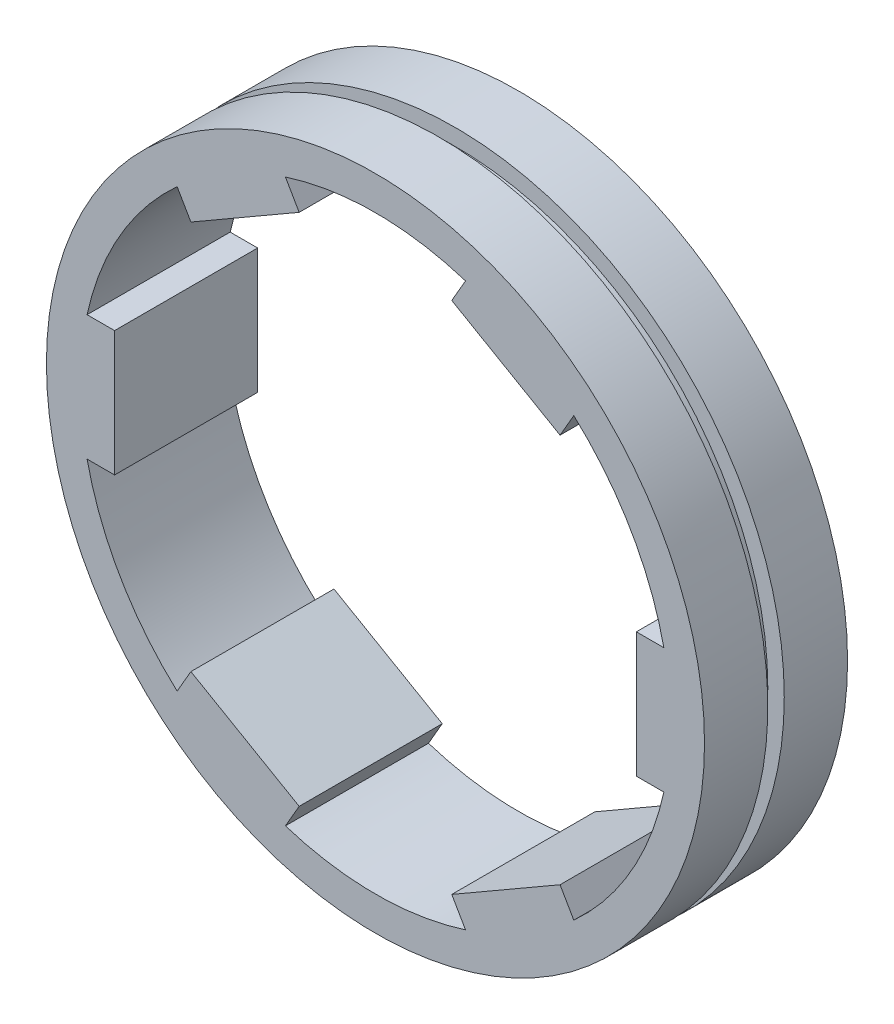
ISO-10303-21;
HEADER;
FILE_DESCRIPTION(('STEP AP214'),'2;1');
FILE_NAME('part.step','',(''),(''),'','','');
FILE_SCHEMA(('AUTOMOTIVE_DESIGN { 1 0 10303 214 1 1 1 1 }'));
ENDSEC;
DATA;
#1=APPLICATION_CONTEXT('core data for automotive mechanical design processes');
#2=APPLICATION_PROTOCOL_DEFINITION('international standard','automotive_design',2000,#1);
#3=PRODUCT_CONTEXT('',#1,'mechanical');
#4=PRODUCT('Part','Part','',(#3));
#5=PRODUCT_RELATED_PRODUCT_CATEGORY('part','',(#4));
#6=PRODUCT_DEFINITION_FORMATION('','',#4);
#7=PRODUCT_DEFINITION_CONTEXT('part definition',#1,'design');
#8=PRODUCT_DEFINITION('design','',#6,#7);
#9=PRODUCT_DEFINITION_SHAPE('','',#8);
#10=(LENGTH_UNIT() NAMED_UNIT(*) SI_UNIT(.MILLI.,.METRE.));
#11=(NAMED_UNIT(*) PLANE_ANGLE_UNIT() SI_UNIT($,.RADIAN.));
#12=(NAMED_UNIT(*) SI_UNIT($,.STERADIAN.) SOLID_ANGLE_UNIT());
#13=UNCERTAINTY_MEASURE_WITH_UNIT(LENGTH_MEASURE(1.E-05),#10,'distance_accuracy_value','');
#14=(GEOMETRIC_REPRESENTATION_CONTEXT(3) GLOBAL_UNCERTAINTY_ASSIGNED_CONTEXT((#13)) GLOBAL_UNIT_ASSIGNED_CONTEXT((#10,
#11,#12)) REPRESENTATION_CONTEXT('',''));
#15=CARTESIAN_POINT('',(0.,0.,0.));
#16=DIRECTION('',(0.,0.,1.));
#17=DIRECTION('',(1.,0.,0.));
#18=AXIS2_PLACEMENT_3D('',#15,#16,#17);
#19=CARTESIAN_POINT('',(0.,0.,10.));
#20=DIRECTION('',(0.,0.,-1.));
#21=DIRECTION('',(-1.,0.,0.));
#22=AXIS2_PLACEMENT_3D('',#19,#20,#21);
#23=CYLINDRICAL_SURFACE('',#22,23.);
#24=CARTESIAN_POINT('',(0.,0.,10.));
#25=DIRECTION('',(0.,0.,1.));
#26=DIRECTION('',(1.,0.,0.));
#27=AXIS2_PLACEMENT_3D('',#24,#25,#26);
#28=CIRCLE('',#27,23.);
#29=CARTESIAN_POINT('',(23.,0.,10.));
#30=VERTEX_POINT('',#29);
#31=EDGE_CURVE('E409',#30,#30,#28,.T.);
#32=ORIENTED_EDGE('',*,*,#31,.F.);
#33=EDGE_LOOP('',(#32));
#34=FACE_BOUND('',#33,.T.);
#35=CARTESIAN_POINT('',(0.,0.,5.575));
#36=DIRECTION('',(0.,0.,-1.));
#37=DIRECTION('',(-1.,0.,0.));
#38=AXIS2_PLACEMENT_3D('',#35,#36,#37);
#39=CIRCLE('',#38,23.);
#40=CARTESIAN_POINT('',(-23.,0.,5.575));
#41=VERTEX_POINT('',#40);
#42=EDGE_CURVE('E52',#41,#41,#39,.T.);
#43=ORIENTED_EDGE('',*,*,#42,.F.);
#44=EDGE_LOOP('',(#43));
#45=FACE_BOUND('',#44,.T.);
#46=ADVANCED_FACE('F49',(#34,#45),#23,.T.);
#47=CARTESIAN_POINT('',(0.,0.,0.));
#48=DIRECTION('',(0.,0.,1.));
#49=DIRECTION('',(1.,0.,0.));
#50=AXIS2_PLACEMENT_3D('',#47,#48,#49);
#51=CIRCLE('',#50,23.);
#52=CARTESIAN_POINT('',(23.,0.,0.));
#53=VERTEX_POINT('',#52);
#54=EDGE_CURVE('E404',#53,#53,#51,.T.);
#55=ORIENTED_EDGE('',*,*,#54,.T.);
#56=EDGE_LOOP('',(#55));
#57=FACE_BOUND('',#56,.T.);
#58=CARTESIAN_POINT('',(0.,0.,4.425));
#59=DIRECTION('',(0.,0.,1.));
#60=DIRECTION('',(1.,0.,0.));
#61=AXIS2_PLACEMENT_3D('',#58,#59,#60);
#62=CIRCLE('',#61,23.);
#63=CARTESIAN_POINT('',(23.,0.,4.425));
#64=VERTEX_POINT('',#63);
#65=EDGE_CURVE('E245',#64,#64,#62,.T.);
#66=ORIENTED_EDGE('',*,*,#65,.F.);
#67=EDGE_LOOP('',(#66));
#68=FACE_BOUND('',#67,.T.);
#69=ADVANCED_FACE('F486',(#57,#68),#23,.T.);
#70=CARTESIAN_POINT('',(0.,0.,10.));
#71=DIRECTION('',(0.,0.,-1.));
#72=DIRECTION('',(-1.,0.,0.));
#73=AXIS2_PLACEMENT_3D('',#70,#71,#72);
#74=CYLINDRICAL_SURFACE('',#73,20.625);
#75=DIRECTION('',(0.,0.,-1.));
#76=VECTOR('',#75,1.);
#77=CARTESIAN_POINT('',(-6.29383349812002,-19.6412393931224,10.));
#78=LINE('',#77,#76);
#79=CARTESIAN_POINT('',(-6.29383349812002,-19.6412393931224,10.));
#80=VERTEX_POINT('',#79);
#81=CARTESIAN_POINT('',(-6.29383349812002,-19.6412393931224,0.));
#82=VERTEX_POINT('',#81);
#83=EDGE_CURVE('E11',#80,#82,#78,.T.);
#84=ORIENTED_EDGE('',*,*,#83,.F.);
#85=CARTESIAN_POINT('',(0.,0.,10.));
#86=DIRECTION('',(0.,0.,1.));
#87=DIRECTION('',(1.,0.,0.));
#88=AXIS2_PLACEMENT_3D('',#85,#86,#87);
#89=CIRCLE('',#88,20.625);
#90=CARTESIAN_POINT('',(6.29383349811962,-19.6412393931225,10.));
#91=VERTEX_POINT('',#90);
#92=EDGE_CURVE('E405',#80,#91,#89,.T.);
#93=ORIENTED_EDGE('',*,*,#92,.T.);
#94=DIRECTION('',(0.,0.,-1.));
#95=VECTOR('',#94,1.);
#96=CARTESIAN_POINT('',(6.29383349811962,-19.6412393931225,10.));
#97=LINE('',#96,#95);
#98=CARTESIAN_POINT('',(6.29383349811962,-19.6412393931225,0.));
#99=VERTEX_POINT('',#98);
#100=EDGE_CURVE('E448',#99,#91,#97,.F.);
#101=ORIENTED_EDGE('',*,*,#100,.F.);
#102=CARTESIAN_POINT('',(0.,0.,0.));
#103=DIRECTION('',(0.,0.,1.));
#104=DIRECTION('',(1.,0.,0.));
#105=AXIS2_PLACEMENT_3D('',#102,#103,#104);
#106=CIRCLE('',#105,20.625);
#107=EDGE_CURVE('E69',#82,#99,#106,.T.);
#108=ORIENTED_EDGE('',*,*,#107,.F.);
#109=EDGE_LOOP('',(#84,#93,#101,#108));
#110=FACE_BOUND('',#109,.T.);
#111=ADVANCED_FACE('F491',(#110),#74,.F.);
#112=DIRECTION('',(0.,0.,-1.));
#113=VECTOR('',#112,1.);
#114=CARTESIAN_POINT('',(13.8628955271957,-15.2712393931226,10.));
#115=LINE('',#114,#113);
#116=CARTESIAN_POINT('',(13.8628955271957,-15.2712393931226,10.));
#117=VERTEX_POINT('',#116);
#118=CARTESIAN_POINT('',(13.8628955271957,-15.2712393931226,0.));
#119=VERTEX_POINT('',#118);
#120=EDGE_CURVE('E452',#117,#119,#115,.T.);
#121=ORIENTED_EDGE('',*,*,#120,.F.);
#122=CARTESIAN_POINT('',(20.1567290253156,-4.36999999999999,10.));
#123=VERTEX_POINT('',#122);
#124=EDGE_CURVE('E888',#117,#123,#89,.T.);
#125=ORIENTED_EDGE('',*,*,#124,.T.);
#126=DIRECTION('',(0.,0.,-1.));
#127=VECTOR('',#126,1.);
#128=CARTESIAN_POINT('',(20.1567290253156,-4.36999999999999,10.));
#129=LINE('',#128,#127);
#130=CARTESIAN_POINT('',(20.1567290253156,-4.36999999999999,0.));
#131=VERTEX_POINT('',#130);
#132=EDGE_CURVE('E440',#131,#123,#129,.F.);
#133=ORIENTED_EDGE('',*,*,#132,.F.);
#134=EDGE_CURVE('E903',#119,#131,#106,.T.);
#135=ORIENTED_EDGE('',*,*,#134,.F.);
#136=EDGE_LOOP('',(#121,#125,#133,#135));
#137=FACE_BOUND('',#136,.T.);
#138=ADVANCED_FACE('F702',(#137),#74,.F.);
#139=DIRECTION('',(0.,0.,-1.));
#140=VECTOR('',#139,1.);
#141=CARTESIAN_POINT('',(20.1567290253156,4.37000000000001,10.));
#142=LINE('',#141,#140);
#143=CARTESIAN_POINT('',(20.1567290253156,4.37000000000001,10.));
#144=VERTEX_POINT('',#143);
#145=CARTESIAN_POINT('',(20.1567290253156,4.37000000000001,0.));
#146=VERTEX_POINT('',#145);
#147=EDGE_CURVE('E444',#144,#146,#142,.T.);
#148=ORIENTED_EDGE('',*,*,#147,.F.);
#149=CARTESIAN_POINT('',(13.8628955271959,15.2712393931224,10.));
#150=VERTEX_POINT('',#149);
#151=EDGE_CURVE('E886',#144,#150,#89,.T.);
#152=ORIENTED_EDGE('',*,*,#151,.T.);
#153=DIRECTION('',(0.,0.,-1.));
#154=VECTOR('',#153,1.);
#155=CARTESIAN_POINT('',(13.8628955271959,15.2712393931224,10.));
#156=LINE('',#155,#154);
#157=CARTESIAN_POINT('',(13.8628955271959,15.2712393931224,0.));
#158=VERTEX_POINT('',#157);
#159=EDGE_CURVE('E432',#158,#150,#156,.F.);
#160=ORIENTED_EDGE('',*,*,#159,.F.);
#161=EDGE_CURVE('E905',#146,#158,#106,.T.);
#162=ORIENTED_EDGE('',*,*,#161,.F.);
#163=EDGE_LOOP('',(#148,#152,#160,#162));
#164=FACE_BOUND('',#163,.T.);
#165=ADVANCED_FACE('F708',(#164),#74,.F.);
#166=DIRECTION('',(0.,0.,-1.));
#167=VECTOR('',#166,1.);
#168=CARTESIAN_POINT('',(6.29383349811988,19.6412393931224,10.));
#169=LINE('',#168,#167);
#170=CARTESIAN_POINT('',(6.29383349811988,19.6412393931224,10.));
#171=VERTEX_POINT('',#170);
#172=CARTESIAN_POINT('',(6.29383349811988,19.6412393931224,0.));
#173=VERTEX_POINT('',#172);
#174=EDGE_CURVE('E436',#171,#173,#169,.T.);
#175=ORIENTED_EDGE('',*,*,#174,.F.);
#176=CARTESIAN_POINT('',(-6.29383349811976,19.6412393931225,10.));
#177=VERTEX_POINT('',#176);
#178=EDGE_CURVE('E876',#171,#177,#89,.T.);
#179=ORIENTED_EDGE('',*,*,#178,.T.);
#180=DIRECTION('',(0.,0.,-1.));
#181=VECTOR('',#180,1.);
#182=CARTESIAN_POINT('',(-6.29383349811976,19.6412393931225,10.));
#183=LINE('',#182,#181);
#184=CARTESIAN_POINT('',(-6.29383349811976,19.6412393931225,0.));
#185=VERTEX_POINT('',#184);
#186=EDGE_CURVE('E424',#185,#177,#183,.F.);
#187=ORIENTED_EDGE('',*,*,#186,.F.);
#188=EDGE_CURVE('E884',#173,#185,#106,.T.);
#189=ORIENTED_EDGE('',*,*,#188,.F.);
#190=EDGE_LOOP('',(#175,#179,#187,#189));
#191=FACE_BOUND('',#190,.T.);
#192=ADVANCED_FACE('F715',(#191),#74,.F.);
#193=DIRECTION('',(0.,0.,-1.));
#194=VECTOR('',#193,1.);
#195=CARTESIAN_POINT('',(-13.8628955271958,15.2712393931225,10.));
#196=LINE('',#195,#194);
#197=CARTESIAN_POINT('',(-13.8628955271958,15.2712393931225,10.));
#198=VERTEX_POINT('',#197);
#199=CARTESIAN_POINT('',(-13.8628955271958,15.2712393931225,0.));
#200=VERTEX_POINT('',#199);
#201=EDGE_CURVE('E428',#198,#200,#196,.T.);
#202=ORIENTED_EDGE('',*,*,#201,.F.);
#203=CARTESIAN_POINT('',(-20.1567290253156,4.36999999999999,10.));
#204=VERTEX_POINT('',#203);
#205=EDGE_CURVE('E406',#198,#204,#89,.T.);
#206=ORIENTED_EDGE('',*,*,#205,.T.);
#207=DIRECTION('',(0.,0.,-1.));
#208=VECTOR('',#207,1.);
#209=CARTESIAN_POINT('',(-20.1567290253156,4.36999999999999,10.));
#210=LINE('',#209,#208);
#211=CARTESIAN_POINT('',(-20.1567290253156,4.36999999999999,0.));
#212=VERTEX_POINT('',#211);
#213=EDGE_CURVE('E413',#212,#204,#210,.F.);
#214=ORIENTED_EDGE('',*,*,#213,.F.);
#215=EDGE_CURVE('E400',#200,#212,#106,.T.);
#216=ORIENTED_EDGE('',*,*,#215,.F.);
#217=EDGE_LOOP('',(#202,#206,#214,#216));
#218=FACE_BOUND('',#217,.T.);
#219=ADVANCED_FACE('F573',(#218),#74,.F.);
#220=CARTESIAN_POINT('',(0.,0.,10.));
#221=DIRECTION('',(0.,0.,1.));
#222=DIRECTION('',(1.,0.,0.));
#223=AXIS2_PLACEMENT_3D('',#220,#221,#222);
#224=PLANE('',#223);
#225=ORIENTED_EDGE('',*,*,#92,.F.);
#226=DIRECTION('',(-0.50000000000001,-0.866025403784433,0.));
#227=VECTOR('',#226,1.);
#228=CARTESIAN_POINT('',(3.78453101453797,-2.18500000000004,10.));
#229=LINE('',#228,#227);
#230=CARTESIAN_POINT('',(-5.33296898546221,-17.9769732380092,10.));
#231=VERTEX_POINT('',#230);
#232=EDGE_CURVE('E221',#231,#80,#229,.T.);
#233=ORIENTED_EDGE('',*,*,#232,.F.);
#234=DIRECTION('',(0.866025403784433,-0.50000000000001,0.));
#235=VECTOR('',#234,1.);
#236=CARTESIAN_POINT('',(-9.11750000000018,-15.7919732380091,10.));
#237=LINE('',#236,#235);
#238=CARTESIAN_POINT('',(-12.9020310145382,-13.6069732380091,10.));
#239=VERTEX_POINT('',#238);
#240=EDGE_CURVE('E233',#239,#231,#237,.T.);
#241=ORIENTED_EDGE('',*,*,#240,.F.);
#242=DIRECTION('',(0.50000000000001,0.866025403784433,0.));
#243=VECTOR('',#242,1.);
#244=CARTESIAN_POINT('',(-3.78453101453797,2.18500000000004,10.));
#245=LINE('',#244,#243);
#246=CARTESIAN_POINT('',(-13.862895527196,-15.2712393931223,10.));
#247=VERTEX_POINT('',#246);
#248=EDGE_CURVE('E228',#247,#239,#245,.T.);
#249=ORIENTED_EDGE('',*,*,#248,.F.);
#250=CARTESIAN_POINT('',(-20.1567290253156,-4.37000000000001,10.));
#251=VERTEX_POINT('',#250);
#252=EDGE_CURVE('E401',#251,#247,#89,.T.);
#253=ORIENTED_EDGE('',*,*,#252,.F.);
#254=DIRECTION('',(-1.,0.,0.));
#255=VECTOR('',#254,1.);
#256=CARTESIAN_POINT('',(0.,-4.37,10.));
#257=LINE('',#256,#255);
#258=CARTESIAN_POINT('',(-18.235,-4.37,10.));
#259=VERTEX_POINT('',#258);
#260=EDGE_CURVE('E376',#259,#251,#257,.T.);
#261=ORIENTED_EDGE('',*,*,#260,.F.);
#262=DIRECTION('',(0.,-1.,0.));
#263=VECTOR('',#262,1.);
#264=CARTESIAN_POINT('',(-18.235,0.,10.));
#265=LINE('',#264,#263);
#266=CARTESIAN_POINT('',(-18.235,4.36999999999999,10.));
#267=VERTEX_POINT('',#266);
#268=EDGE_CURVE('E387',#267,#259,#265,.T.);
#269=ORIENTED_EDGE('',*,*,#268,.F.);
#270=DIRECTION('',(1.,0.,0.));
#271=VECTOR('',#270,1.);
#272=CARTESIAN_POINT('',(0.,4.37,10.));
#273=LINE('',#272,#271);
#274=EDGE_CURVE('E386',#204,#267,#273,.T.);
#275=ORIENTED_EDGE('',*,*,#274,.F.);
#276=ORIENTED_EDGE('',*,*,#205,.F.);
#277=DIRECTION('',(-0.499999999999998,0.866025403784439,0.));
#278=VECTOR('',#277,1.);
#279=CARTESIAN_POINT('',(-3.784531014538,-2.18499999999999,10.));
#280=LINE('',#279,#278);
#281=CARTESIAN_POINT('',(-12.902031014538,13.6069732380093,10.));
#282=VERTEX_POINT('',#281);
#283=EDGE_CURVE('E347',#282,#198,#280,.T.);
#284=ORIENTED_EDGE('',*,*,#283,.F.);
#285=DIRECTION('',(-0.866025403784439,-0.499999999999998,0.));
#286=VECTOR('',#285,1.);
#287=CARTESIAN_POINT('',(-9.11749999999997,15.7919732380093,10.));
#288=LINE('',#287,#286);
#289=CARTESIAN_POINT('',(-5.33296898546197,17.9769732380093,10.));
#290=VERTEX_POINT('',#289);
#291=EDGE_CURVE('E359',#290,#282,#288,.T.);
#292=ORIENTED_EDGE('',*,*,#291,.F.);
#293=DIRECTION('',(0.499999999999998,-0.866025403784439,0.));
#294=VECTOR('',#293,1.);
#295=CARTESIAN_POINT('',(3.784531014538,2.18499999999999,10.));
#296=LINE('',#295,#294);
#297=EDGE_CURVE('E358',#177,#290,#296,.T.);
#298=ORIENTED_EDGE('',*,*,#297,.F.);
#299=ORIENTED_EDGE('',*,*,#178,.F.);
#300=DIRECTION('',(0.500000000000004,0.866025403784437,0.));
#301=VECTOR('',#300,1.);
#302=CARTESIAN_POINT('',(-3.78453101453799,2.18500000000002,10.));
#303=LINE('',#302,#301);
#304=CARTESIAN_POINT('',(5.33296898546208,17.9769732380092,10.));
#305=VERTEX_POINT('',#304);
#306=EDGE_CURVE('E318',#305,#171,#303,.T.);
#307=ORIENTED_EDGE('',*,*,#306,.F.);
#308=DIRECTION('',(-0.866025403784437,0.500000000000004,0.));
#309=VECTOR('',#308,1.);
#310=CARTESIAN_POINT('',(9.11750000000007,15.7919732380092,10.));
#311=LINE('',#310,#309);
#312=CARTESIAN_POINT('',(12.9020310145381,13.6069732380092,10.));
#313=VERTEX_POINT('',#312);
#314=EDGE_CURVE('E330',#313,#305,#311,.T.);
#315=ORIENTED_EDGE('',*,*,#314,.F.);
#316=DIRECTION('',(-0.500000000000004,-0.866025403784437,0.));
#317=VECTOR('',#316,1.);
#318=CARTESIAN_POINT('',(3.78453101453799,-2.18500000000002,10.));
#319=LINE('',#318,#317);
#320=EDGE_CURVE('E329',#150,#313,#319,.T.);
#321=ORIENTED_EDGE('',*,*,#320,.F.);
#322=ORIENTED_EDGE('',*,*,#151,.F.);
#323=DIRECTION('',(1.,0.,0.));
#324=VECTOR('',#323,1.);
#325=CARTESIAN_POINT('',(0.,4.37,10.));
#326=LINE('',#325,#324);
#327=CARTESIAN_POINT('',(18.235,4.37,10.));
#328=VERTEX_POINT('',#327);
#329=EDGE_CURVE('E289',#328,#144,#326,.T.);
#330=ORIENTED_EDGE('',*,*,#329,.F.);
#331=DIRECTION('',(0.,1.,0.));
#332=VECTOR('',#331,1.);
#333=CARTESIAN_POINT('',(18.235,0.,10.));
#334=LINE('',#333,#332);
#335=CARTESIAN_POINT('',(18.235,-4.36999999999999,10.));
#336=VERTEX_POINT('',#335);
#337=EDGE_CURVE('E301',#336,#328,#334,.T.);
#338=ORIENTED_EDGE('',*,*,#337,.F.);
#339=DIRECTION('',(-1.,0.,0.));
#340=VECTOR('',#339,1.);
#341=CARTESIAN_POINT('',(0.,-4.37,10.));
#342=LINE('',#341,#340);
#343=EDGE_CURVE('E300',#123,#336,#342,.T.);
#344=ORIENTED_EDGE('',*,*,#343,.F.);
#345=ORIENTED_EDGE('',*,*,#124,.F.);
#346=DIRECTION('',(0.499999999999992,-0.866025403784443,0.));
#347=VECTOR('',#346,1.);
#348=CARTESIAN_POINT('',(3.78453101453801,2.18499999999996,10.));
#349=LINE('',#348,#347);
#350=CARTESIAN_POINT('',(12.9020310145379,-13.6069732380094,10.));
#351=VERTEX_POINT('',#350);
#352=EDGE_CURVE('E260',#351,#117,#349,.T.);
#353=ORIENTED_EDGE('',*,*,#352,.F.);
#354=DIRECTION('',(0.866025403784443,0.499999999999992,0.));
#355=VECTOR('',#354,1.);
#356=CARTESIAN_POINT('',(9.11749999999986,-15.7919732380093,10.));
#357=LINE('',#356,#355);
#358=CARTESIAN_POINT('',(5.33296898546184,-17.9769732380093,10.));
#359=VERTEX_POINT('',#358);
#360=EDGE_CURVE('E272',#359,#351,#357,.T.);
#361=ORIENTED_EDGE('',*,*,#360,.F.);
#362=DIRECTION('',(-0.499999999999992,0.866025403784443,0.));
#363=VECTOR('',#362,1.);
#364=CARTESIAN_POINT('',(-3.78453101453802,-2.18499999999997,10.));
#365=LINE('',#364,#363);
#366=EDGE_CURVE('E271',#91,#359,#365,.T.);
#367=ORIENTED_EDGE('',*,*,#366,.F.);
#368=EDGE_LOOP('',(#225,#233,#241,#249,#253,#261,#269,#275,#276,#284,#292,#298,#299,#307,#315,
#321,#322,#330,#338,#344,#345,#353,#361,#367));
#369=FACE_BOUND('',#368,.T.);
#370=ORIENTED_EDGE('',*,*,#31,.T.);
#371=EDGE_LOOP('',(#370));
#372=FACE_BOUND('',#371,.T.);
#373=ADVANCED_FACE('F574',(#369,#372),#224,.T.);
#374=CARTESIAN_POINT('',(0.,0.,0.));
#375=DIRECTION('',(0.,0.,1.));
#376=DIRECTION('',(1.,0.,0.));
#377=AXIS2_PLACEMENT_3D('',#374,#375,#376);
#378=PLANE('',#377);
#379=DIRECTION('',(-0.50000000000001,-0.866025403784433,0.));
#380=VECTOR('',#379,1.);
#381=CARTESIAN_POINT('',(3.78453101453797,-2.18500000000004,0.));
#382=LINE('',#381,#380);
#383=CARTESIAN_POINT('',(-5.33296898546221,-17.9769732380092,0.));
#384=VERTEX_POINT('',#383);
#385=EDGE_CURVE('E222',#384,#82,#382,.T.);
#386=ORIENTED_EDGE('',*,*,#385,.T.);
#387=ORIENTED_EDGE('',*,*,#107,.T.);
#388=DIRECTION('',(-0.499999999999992,0.866025403784443,0.));
#389=VECTOR('',#388,1.);
#390=CARTESIAN_POINT('',(-3.78453101453802,-2.18499999999997,0.));
#391=LINE('',#390,#389);
#392=CARTESIAN_POINT('',(5.33296898546184,-17.9769732380093,0.));
#393=VERTEX_POINT('',#392);
#394=EDGE_CURVE('E257',#99,#393,#391,.T.);
#395=ORIENTED_EDGE('',*,*,#394,.T.);
#396=DIRECTION('',(0.866025403784443,0.499999999999992,0.));
#397=VECTOR('',#396,1.);
#398=CARTESIAN_POINT('',(9.11749999999986,-15.7919732380093,0.));
#399=LINE('',#398,#397);
#400=CARTESIAN_POINT('',(12.9020310145379,-13.6069732380094,0.));
#401=VERTEX_POINT('',#400);
#402=EDGE_CURVE('E256',#393,#401,#399,.T.);
#403=ORIENTED_EDGE('',*,*,#402,.T.);
#404=DIRECTION('',(0.499999999999992,-0.866025403784443,0.));
#405=VECTOR('',#404,1.);
#406=CARTESIAN_POINT('',(3.78453101453801,2.18499999999996,0.));
#407=LINE('',#406,#405);
#408=EDGE_CURVE('E261',#401,#119,#407,.T.);
#409=ORIENTED_EDGE('',*,*,#408,.T.);
#410=ORIENTED_EDGE('',*,*,#134,.T.);
#411=DIRECTION('',(-1.,0.,0.));
#412=VECTOR('',#411,1.);
#413=CARTESIAN_POINT('',(0.,-4.37,0.));
#414=LINE('',#413,#412);
#415=CARTESIAN_POINT('',(18.235,-4.36999999999999,0.));
#416=VERTEX_POINT('',#415);
#417=EDGE_CURVE('E286',#131,#416,#414,.T.);
#418=ORIENTED_EDGE('',*,*,#417,.T.);
#419=DIRECTION('',(0.,1.,0.));
#420=VECTOR('',#419,1.);
#421=CARTESIAN_POINT('',(18.235,0.,0.));
#422=LINE('',#421,#420);
#423=CARTESIAN_POINT('',(18.235,4.37,0.));
#424=VERTEX_POINT('',#423);
#425=EDGE_CURVE('E285',#416,#424,#422,.T.);
#426=ORIENTED_EDGE('',*,*,#425,.T.);
#427=DIRECTION('',(1.,0.,0.));
#428=VECTOR('',#427,1.);
#429=CARTESIAN_POINT('',(0.,4.37,0.));
#430=LINE('',#429,#428);
#431=EDGE_CURVE('E290',#424,#146,#430,.T.);
#432=ORIENTED_EDGE('',*,*,#431,.T.);
#433=ORIENTED_EDGE('',*,*,#161,.T.);
#434=DIRECTION('',(-0.500000000000004,-0.866025403784437,0.));
#435=VECTOR('',#434,1.);
#436=CARTESIAN_POINT('',(3.78453101453799,-2.18500000000002,0.));
#437=LINE('',#436,#435);
#438=CARTESIAN_POINT('',(12.9020310145381,13.6069732380092,0.));
#439=VERTEX_POINT('',#438);
#440=EDGE_CURVE('E315',#158,#439,#437,.T.);
#441=ORIENTED_EDGE('',*,*,#440,.T.);
#442=DIRECTION('',(-0.866025403784437,0.500000000000004,0.));
#443=VECTOR('',#442,1.);
#444=CARTESIAN_POINT('',(9.11750000000007,15.7919732380092,0.));
#445=LINE('',#444,#443);
#446=CARTESIAN_POINT('',(5.33296898546209,17.9769732380092,0.));
#447=VERTEX_POINT('',#446);
#448=EDGE_CURVE('E314',#439,#447,#445,.T.);
#449=ORIENTED_EDGE('',*,*,#448,.T.);
#450=DIRECTION('',(0.500000000000004,0.866025403784437,0.));
#451=VECTOR('',#450,1.);
#452=CARTESIAN_POINT('',(-3.78453101453799,2.18500000000002,0.));
#453=LINE('',#452,#451);
#454=EDGE_CURVE('E319',#447,#173,#453,.T.);
#455=ORIENTED_EDGE('',*,*,#454,.T.);
#456=ORIENTED_EDGE('',*,*,#188,.T.);
#457=DIRECTION('',(0.499999999999998,-0.86602540378444,0.));
#458=VECTOR('',#457,1.);
#459=CARTESIAN_POINT('',(3.784531014538,2.18499999999999,0.));
#460=LINE('',#459,#458);
#461=CARTESIAN_POINT('',(-5.33296898546197,17.9769732380093,0.));
#462=VERTEX_POINT('',#461);
#463=EDGE_CURVE('E344',#185,#462,#460,.T.);
#464=ORIENTED_EDGE('',*,*,#463,.T.);
#465=DIRECTION('',(-0.86602540378444,-0.499999999999998,0.));
#466=VECTOR('',#465,1.);
#467=CARTESIAN_POINT('',(-9.11749999999997,15.7919732380093,0.));
#468=LINE('',#467,#466);
#469=CARTESIAN_POINT('',(-12.902031014538,13.6069732380093,0.));
#470=VERTEX_POINT('',#469);
#471=EDGE_CURVE('E343',#462,#470,#468,.T.);
#472=ORIENTED_EDGE('',*,*,#471,.T.);
#473=DIRECTION('',(-0.499999999999998,0.86602540378444,0.));
#474=VECTOR('',#473,1.);
#475=CARTESIAN_POINT('',(-3.784531014538,-2.18499999999999,0.));
#476=LINE('',#475,#474);
#477=EDGE_CURVE('E348',#470,#200,#476,.T.);
#478=ORIENTED_EDGE('',*,*,#477,.T.);
#479=ORIENTED_EDGE('',*,*,#215,.T.);
#480=DIRECTION('',(1.,0.,0.));
#481=VECTOR('',#480,1.);
#482=CARTESIAN_POINT('',(0.,4.37,0.));
#483=LINE('',#482,#481);
#484=CARTESIAN_POINT('',(-18.235,4.36999999999999,0.));
#485=VERTEX_POINT('',#484);
#486=EDGE_CURVE('E373',#212,#485,#483,.T.);
#487=ORIENTED_EDGE('',*,*,#486,.T.);
#488=DIRECTION('',(0.,-1.,0.));
#489=VECTOR('',#488,1.);
#490=CARTESIAN_POINT('',(-18.235,0.,0.));
#491=LINE('',#490,#489);
#492=CARTESIAN_POINT('',(-18.235,-4.37,0.));
#493=VERTEX_POINT('',#492);
#494=EDGE_CURVE('E372',#485,#493,#491,.T.);
#495=ORIENTED_EDGE('',*,*,#494,.T.);
#496=DIRECTION('',(-1.,0.,0.));
#497=VECTOR('',#496,1.);
#498=CARTESIAN_POINT('',(0.,-4.37,0.));
#499=LINE('',#498,#497);
#500=CARTESIAN_POINT('',(-20.1567290253156,-4.37000000000001,0.));
#501=VERTEX_POINT('',#500);
#502=EDGE_CURVE('E377',#493,#501,#499,.T.);
#503=ORIENTED_EDGE('',*,*,#502,.T.);
#504=CARTESIAN_POINT('',(-13.862895527196,-15.2712393931223,0.));
#505=VERTEX_POINT('',#504);
#506=EDGE_CURVE('E217',#501,#505,#106,.T.);
#507=ORIENTED_EDGE('',*,*,#506,.T.);
#508=DIRECTION('',(0.50000000000001,0.866025403784433,0.));
#509=VECTOR('',#508,1.);
#510=CARTESIAN_POINT('',(-3.78453101453797,2.18500000000004,0.));
#511=LINE('',#510,#509);
#512=CARTESIAN_POINT('',(-12.9020310145382,-13.6069732380091,0.));
#513=VERTEX_POINT('',#512);
#514=EDGE_CURVE('E209',#505,#513,#511,.T.);
#515=ORIENTED_EDGE('',*,*,#514,.T.);
#516=DIRECTION('',(0.866025403784433,-0.50000000000001,0.));
#517=VECTOR('',#516,1.);
#518=CARTESIAN_POINT('',(-9.11750000000018,-15.7919732380091,0.));
#519=LINE('',#518,#517);
#520=EDGE_CURVE('E215',#513,#384,#519,.T.);
#521=ORIENTED_EDGE('',*,*,#520,.T.);
#522=EDGE_LOOP('',(#386,#387,#395,#403,#409,#410,#418,#426,#432,#433,#441,#449,#455,#456,#464,
#472,#478,#479,#487,#495,#503,#507,#515,#521));
#523=FACE_BOUND('',#522,.T.);
#524=ORIENTED_EDGE('',*,*,#54,.F.);
#525=EDGE_LOOP('',(#524));
#526=FACE_BOUND('',#525,.T.);
#527=ADVANCED_FACE('F212',(#523,#526),#378,.F.);
#528=DIRECTION('',(0.,0.,-1.));
#529=VECTOR('',#528,1.);
#530=CARTESIAN_POINT('',(-13.862895527196,-15.2712393931223,10.));
#531=LINE('',#530,#529);
#532=EDGE_CURVE('E58',#505,#247,#531,.F.);
#533=ORIENTED_EDGE('',*,*,#532,.F.);
#534=ORIENTED_EDGE('',*,*,#506,.F.);
#535=DIRECTION('',(0.,0.,-1.));
#536=VECTOR('',#535,1.);
#537=CARTESIAN_POINT('',(-20.1567290253156,-4.37000000000001,10.));
#538=LINE('',#537,#536);
#539=EDGE_CURVE('E420',#251,#501,#538,.T.);
#540=ORIENTED_EDGE('',*,*,#539,.F.);
#541=ORIENTED_EDGE('',*,*,#252,.T.);
#542=EDGE_LOOP('',(#533,#534,#540,#541));
#543=FACE_BOUND('',#542,.T.);
#544=ADVANCED_FACE('F568',(#543),#74,.F.);
#545=CARTESIAN_POINT('',(0.,-4.37,19.0988186046321));
#546=DIRECTION('',(0.,-1.,0.));
#547=DIRECTION('',(1.,0.,0.));
#548=AXIS2_PLACEMENT_3D('',#545,#546,#547);
#549=PLANE('',#548);
#550=ORIENTED_EDGE('',*,*,#260,.T.);
#551=ORIENTED_EDGE('',*,*,#539,.T.);
#552=ORIENTED_EDGE('',*,*,#502,.F.);
#553=DIRECTION('',(0.,0.,-1.));
#554=VECTOR('',#553,1.);
#555=CARTESIAN_POINT('',(-18.235,-4.37,19.0988186046321));
#556=LINE('',#555,#554);
#557=EDGE_CURVE('E391',#259,#493,#556,.T.);
#558=ORIENTED_EDGE('',*,*,#557,.F.);
#559=EDGE_LOOP('',(#550,#551,#552,#558));
#560=FACE_BOUND('',#559,.T.);
#561=ADVANCED_FACE('F564',(#560),#549,.T.);
#562=CARTESIAN_POINT('',(0.,4.37,19.0988186046321));
#563=DIRECTION('',(0.,1.,0.));
#564=DIRECTION('',(-1.,0.,0.));
#565=AXIS2_PLACEMENT_3D('',#562,#563,#564);
#566=PLANE('',#565);
#567=ORIENTED_EDGE('',*,*,#486,.F.);
#568=ORIENTED_EDGE('',*,*,#213,.T.);
#569=ORIENTED_EDGE('',*,*,#274,.T.);
#570=DIRECTION('',(0.,0.,-1.));
#571=VECTOR('',#570,1.);
#572=CARTESIAN_POINT('',(-18.235,4.36999999999999,19.0988186046321));
#573=LINE('',#572,#571);
#574=EDGE_CURVE('E392',#267,#485,#573,.T.);
#575=ORIENTED_EDGE('',*,*,#574,.T.);
#576=EDGE_LOOP('',(#567,#568,#569,#575));
#577=FACE_BOUND('',#576,.T.);
#578=ADVANCED_FACE('F560',(#577),#566,.T.);
#579=CARTESIAN_POINT('',(-18.235,0.,19.0988186046321));
#580=DIRECTION('',(1.,0.,0.));
#581=DIRECTION('',(0.,1.,0.));
#582=AXIS2_PLACEMENT_3D('',#579,#580,#581);
#583=PLANE('',#582);
#584=ORIENTED_EDGE('',*,*,#574,.F.);
#585=ORIENTED_EDGE('',*,*,#268,.T.);
#586=ORIENTED_EDGE('',*,*,#557,.T.);
#587=ORIENTED_EDGE('',*,*,#494,.F.);
#588=EDGE_LOOP('',(#584,#585,#586,#587));
#589=FACE_BOUND('',#588,.T.);
#590=ADVANCED_FACE('F556',(#589),#583,.T.);
#591=CARTESIAN_POINT('',(-3.784531014538,-2.18499999999999,21.0039971768046));
#592=DIRECTION('',(-0.86602540378444,-0.499999999999998,0.));
#593=DIRECTION('',(0.499999999999998,-0.866025403784439,0.));
#594=AXIS2_PLACEMENT_3D('',#591,#592,#593);
#595=PLANE('',#594);
#596=ORIENTED_EDGE('',*,*,#283,.T.);
#597=ORIENTED_EDGE('',*,*,#201,.T.);
#598=ORIENTED_EDGE('',*,*,#477,.F.);
#599=DIRECTION('',(0.,0.,-1.));
#600=VECTOR('',#599,1.);
#601=CARTESIAN_POINT('',(-12.902031014538,13.6069732380093,21.0039971768046));
#602=LINE('',#601,#600);
#603=EDGE_CURVE('E363',#282,#470,#602,.T.);
#604=ORIENTED_EDGE('',*,*,#603,.F.);
#605=EDGE_LOOP('',(#596,#597,#598,#604));
#606=FACE_BOUND('',#605,.T.);
#607=ADVANCED_FACE('F552',(#606),#595,.T.);
#608=CARTESIAN_POINT('',(3.784531014538,2.18499999999999,21.0039971768046));
#609=DIRECTION('',(0.86602540378444,0.499999999999998,0.));
#610=DIRECTION('',(-0.499999999999998,0.866025403784439,0.));
#611=AXIS2_PLACEMENT_3D('',#608,#609,#610);
#612=PLANE('',#611);
#613=ORIENTED_EDGE('',*,*,#463,.F.);
#614=ORIENTED_EDGE('',*,*,#186,.T.);
#615=ORIENTED_EDGE('',*,*,#297,.T.);
#616=DIRECTION('',(0.,0.,-1.));
#617=VECTOR('',#616,1.);
#618=CARTESIAN_POINT('',(-5.33296898546197,17.9769732380093,21.0039971768046));
#619=LINE('',#618,#617);
#620=EDGE_CURVE('E364',#290,#462,#619,.T.);
#621=ORIENTED_EDGE('',*,*,#620,.T.);
#622=EDGE_LOOP('',(#613,#614,#615,#621));
#623=FACE_BOUND('',#622,.T.);
#624=ADVANCED_FACE('F548',(#623),#612,.T.);
#625=CARTESIAN_POINT('',(-9.11749999999997,15.7919732380093,21.0039971768046));
#626=DIRECTION('',(0.499999999999998,-0.86602540378444,0.));
#627=DIRECTION('',(0.866025403784439,0.499999999999998,0.));
#628=AXIS2_PLACEMENT_3D('',#625,#626,#627);
#629=PLANE('',#628);
#630=ORIENTED_EDGE('',*,*,#620,.F.);
#631=ORIENTED_EDGE('',*,*,#291,.T.);
#632=ORIENTED_EDGE('',*,*,#603,.T.);
#633=ORIENTED_EDGE('',*,*,#471,.F.);
#634=EDGE_LOOP('',(#630,#631,#632,#633));
#635=FACE_BOUND('',#634,.T.);
#636=ADVANCED_FACE('F544',(#635),#629,.T.);
#637=CARTESIAN_POINT('',(-3.78453101453799,2.18500000000002,21.0039971768047));
#638=DIRECTION('',(-0.866025403784436,0.500000000000004,0.));
#639=DIRECTION('',(-0.500000000000004,-0.866025403784437,0.));
#640=AXIS2_PLACEMENT_3D('',#637,#638,#639);
#641=PLANE('',#640);
#642=ORIENTED_EDGE('',*,*,#306,.T.);
#643=ORIENTED_EDGE('',*,*,#174,.T.);
#644=ORIENTED_EDGE('',*,*,#454,.F.);
#645=DIRECTION('',(0.,0.,-1.));
#646=VECTOR('',#645,1.);
#647=CARTESIAN_POINT('',(5.33296898546209,17.9769732380092,21.0039971768047));
#648=LINE('',#647,#646);
#649=EDGE_CURVE('E334',#305,#447,#648,.T.);
#650=ORIENTED_EDGE('',*,*,#649,.F.);
#651=EDGE_LOOP('',(#642,#643,#644,#650));
#652=FACE_BOUND('',#651,.T.);
#653=ADVANCED_FACE('F540',(#652),#641,.T.);
#654=CARTESIAN_POINT('',(3.78453101453799,-2.18500000000002,21.0039971768047));
#655=DIRECTION('',(0.866025403784436,-0.500000000000004,0.));
#656=DIRECTION('',(0.500000000000004,0.866025403784437,0.));
#657=AXIS2_PLACEMENT_3D('',#654,#655,#656);
#658=PLANE('',#657);
#659=ORIENTED_EDGE('',*,*,#440,.F.);
#660=ORIENTED_EDGE('',*,*,#159,.T.);
#661=ORIENTED_EDGE('',*,*,#320,.T.);
#662=DIRECTION('',(0.,0.,-1.));
#663=VECTOR('',#662,1.);
#664=CARTESIAN_POINT('',(12.9020310145381,13.6069732380092,21.0039971768047));
#665=LINE('',#664,#663);
#666=EDGE_CURVE('E335',#313,#439,#665,.T.);
#667=ORIENTED_EDGE('',*,*,#666,.T.);
#668=EDGE_LOOP('',(#659,#660,#661,#667));
#669=FACE_BOUND('',#668,.T.);
#670=ADVANCED_FACE('F536',(#669),#658,.T.);
#671=CARTESIAN_POINT('',(9.11750000000007,15.7919732380092,21.0039971768047));
#672=DIRECTION('',(-0.500000000000004,-0.866025403784436,0.));
#673=DIRECTION('',(0.866025403784437,-0.500000000000004,0.));
#674=AXIS2_PLACEMENT_3D('',#671,#672,#673);
#675=PLANE('',#674);
#676=ORIENTED_EDGE('',*,*,#666,.F.);
#677=ORIENTED_EDGE('',*,*,#314,.T.);
#678=ORIENTED_EDGE('',*,*,#649,.T.);
#679=ORIENTED_EDGE('',*,*,#448,.F.);
#680=EDGE_LOOP('',(#676,#677,#678,#679));
#681=FACE_BOUND('',#680,.T.);
#682=ADVANCED_FACE('F532',(#681),#675,.T.);
#683=CARTESIAN_POINT('',(0.,4.37,19.0988186046321));
#684=DIRECTION('',(0.,1.,0.));
#685=DIRECTION('',(-1.,0.,0.));
#686=AXIS2_PLACEMENT_3D('',#683,#684,#685);
#687=PLANE('',#686);
#688=ORIENTED_EDGE('',*,*,#329,.T.);
#689=ORIENTED_EDGE('',*,*,#147,.T.);
#690=ORIENTED_EDGE('',*,*,#431,.F.);
#691=DIRECTION('',(0.,0.,-1.));
#692=VECTOR('',#691,1.);
#693=CARTESIAN_POINT('',(18.235,4.37,19.0988186046321));
#694=LINE('',#693,#692);
#695=EDGE_CURVE('E305',#328,#424,#694,.T.);
#696=ORIENTED_EDGE('',*,*,#695,.F.);
#697=EDGE_LOOP('',(#688,#689,#690,#696));
#698=FACE_BOUND('',#697,.T.);
#699=ADVANCED_FACE('F528',(#698),#687,.T.);
#700=CARTESIAN_POINT('',(0.,-4.37,19.0988186046321));
#701=DIRECTION('',(0.,-1.,0.));
#702=DIRECTION('',(1.,0.,0.));
#703=AXIS2_PLACEMENT_3D('',#700,#701,#702);
#704=PLANE('',#703);
#705=ORIENTED_EDGE('',*,*,#417,.F.);
#706=ORIENTED_EDGE('',*,*,#132,.T.);
#707=ORIENTED_EDGE('',*,*,#343,.T.);
#708=DIRECTION('',(0.,0.,-1.));
#709=VECTOR('',#708,1.);
#710=CARTESIAN_POINT('',(18.235,-4.36999999999999,19.0988186046321));
#711=LINE('',#710,#709);
#712=EDGE_CURVE('E306',#336,#416,#711,.T.);
#713=ORIENTED_EDGE('',*,*,#712,.T.);
#714=EDGE_LOOP('',(#705,#706,#707,#713));
#715=FACE_BOUND('',#714,.T.);
#716=ADVANCED_FACE('F524',(#715),#704,.T.);
#717=CARTESIAN_POINT('',(18.235,0.,19.0988186046321));
#718=DIRECTION('',(-1.,0.,0.));
#719=DIRECTION('',(0.,-1.,0.));
#720=AXIS2_PLACEMENT_3D('',#717,#718,#719);
#721=PLANE('',#720);
#722=ORIENTED_EDGE('',*,*,#712,.F.);
#723=ORIENTED_EDGE('',*,*,#337,.T.);
#724=ORIENTED_EDGE('',*,*,#695,.T.);
#725=ORIENTED_EDGE('',*,*,#425,.F.);
#726=EDGE_LOOP('',(#722,#723,#724,#725));
#727=FACE_BOUND('',#726,.T.);
#728=ADVANCED_FACE('F520',(#727),#721,.T.);
#729=CARTESIAN_POINT('',(3.78453101453801,2.18499999999996,21.0039971768046));
#730=DIRECTION('',(0.866025403784443,0.499999999999992,0.));
#731=DIRECTION('',(-0.499999999999992,0.866025403784443,0.));
#732=AXIS2_PLACEMENT_3D('',#729,#730,#731);
#733=PLANE('',#732);
#734=ORIENTED_EDGE('',*,*,#352,.T.);
#735=ORIENTED_EDGE('',*,*,#120,.T.);
#736=ORIENTED_EDGE('',*,*,#408,.F.);
#737=DIRECTION('',(0.,0.,-1.));
#738=VECTOR('',#737,1.);
#739=CARTESIAN_POINT('',(12.9020310145379,-13.6069732380094,21.0039971768046));
#740=LINE('',#739,#738);
#741=EDGE_CURVE('E276',#351,#401,#740,.T.);
#742=ORIENTED_EDGE('',*,*,#741,.F.);
#743=EDGE_LOOP('',(#734,#735,#736,#742));
#744=FACE_BOUND('',#743,.T.);
#745=ADVANCED_FACE('F516',(#744),#733,.T.);
#746=CARTESIAN_POINT('',(-3.78453101453802,-2.18499999999997,21.0039971768046));
#747=DIRECTION('',(-0.866025403784443,-0.499999999999992,0.));
#748=DIRECTION('',(0.499999999999992,-0.866025403784443,0.));
#749=AXIS2_PLACEMENT_3D('',#746,#747,#748);
#750=PLANE('',#749);
#751=ORIENTED_EDGE('',*,*,#394,.F.);
#752=ORIENTED_EDGE('',*,*,#100,.T.);
#753=ORIENTED_EDGE('',*,*,#366,.T.);
#754=DIRECTION('',(0.,0.,-1.));
#755=VECTOR('',#754,1.);
#756=CARTESIAN_POINT('',(5.33296898546184,-17.9769732380093,21.0039971768046));
#757=LINE('',#756,#755);
#758=EDGE_CURVE('E277',#359,#393,#757,.T.);
#759=ORIENTED_EDGE('',*,*,#758,.T.);
#760=EDGE_LOOP('',(#751,#752,#753,#759));
#761=FACE_BOUND('',#760,.T.);
#762=ADVANCED_FACE('F512',(#761),#750,.T.);
#763=CARTESIAN_POINT('',(9.11749999999986,-15.7919732380093,21.0039971768046));
#764=DIRECTION('',(-0.499999999999992,0.866025403784443,0.));
#765=DIRECTION('',(-0.866025403784443,-0.499999999999992,0.));
#766=AXIS2_PLACEMENT_3D('',#763,#764,#765);
#767=PLANE('',#766);
#768=ORIENTED_EDGE('',*,*,#758,.F.);
#769=ORIENTED_EDGE('',*,*,#360,.T.);
#770=ORIENTED_EDGE('',*,*,#741,.T.);
#771=ORIENTED_EDGE('',*,*,#402,.F.);
#772=EDGE_LOOP('',(#768,#769,#770,#771));
#773=FACE_BOUND('',#772,.T.);
#774=ADVANCED_FACE('F508',(#773),#767,.T.);
#775=CARTESIAN_POINT('',(3.78453101453797,-2.18500000000004,21.0039971768047));
#776=DIRECTION('',(0.866025403784433,-0.50000000000001,0.));
#777=DIRECTION('',(0.50000000000001,0.866025403784433,0.));
#778=AXIS2_PLACEMENT_3D('',#775,#776,#777);
#779=PLANE('',#778);
#780=ORIENTED_EDGE('',*,*,#232,.T.);
#781=ORIENTED_EDGE('',*,*,#83,.T.);
#782=ORIENTED_EDGE('',*,*,#385,.F.);
#783=DIRECTION('',(0.,0.,-1.));
#784=VECTOR('',#783,1.);
#785=CARTESIAN_POINT('',(-5.33296898546221,-17.9769732380092,21.0039971768047));
#786=LINE('',#785,#784);
#787=EDGE_CURVE('E237',#231,#384,#786,.T.);
#788=ORIENTED_EDGE('',*,*,#787,.F.);
#789=EDGE_LOOP('',(#780,#781,#782,#788));
#790=FACE_BOUND('',#789,.T.);
#791=ADVANCED_FACE('F505',(#790),#779,.T.);
#792=CARTESIAN_POINT('',(-3.78453101453797,2.18500000000004,21.0039971768047));
#793=DIRECTION('',(-0.866025403784433,0.50000000000001,0.));
#794=DIRECTION('',(-0.50000000000001,-0.866025403784433,0.));
#795=AXIS2_PLACEMENT_3D('',#792,#793,#794);
#796=PLANE('',#795);
#797=ORIENTED_EDGE('',*,*,#514,.F.);
#798=ORIENTED_EDGE('',*,*,#532,.T.);
#799=ORIENTED_EDGE('',*,*,#248,.T.);
#800=DIRECTION('',(0.,0.,-1.));
#801=VECTOR('',#800,1.);
#802=CARTESIAN_POINT('',(-12.9020310145382,-13.6069732380091,21.0039971768047));
#803=LINE('',#802,#801);
#804=EDGE_CURVE('E225',#239,#513,#803,.T.);
#805=ORIENTED_EDGE('',*,*,#804,.T.);
#806=EDGE_LOOP('',(#797,#798,#799,#805));
#807=FACE_BOUND('',#806,.T.);
#808=ADVANCED_FACE('F226',(#807),#796,.T.);
#809=CARTESIAN_POINT('',(-9.11750000000018,-15.7919732380091,21.0039971768047));
#810=DIRECTION('',(0.50000000000001,0.866025403784433,0.));
#811=DIRECTION('',(-0.866025403784433,0.50000000000001,0.));
#812=AXIS2_PLACEMENT_3D('',#809,#810,#811);
#813=PLANE('',#812);
#814=ORIENTED_EDGE('',*,*,#804,.F.);
#815=ORIENTED_EDGE('',*,*,#240,.T.);
#816=ORIENTED_EDGE('',*,*,#787,.T.);
#817=ORIENTED_EDGE('',*,*,#520,.F.);
#818=EDGE_LOOP('',(#814,#815,#816,#817));
#819=FACE_BOUND('',#818,.T.);
#820=ADVANCED_FACE('F235',(#819),#813,.T.);
#821=CARTESIAN_POINT('',(0.,24.15,5.575));
#822=DIRECTION('',(0.,0.,-1.));
#823=DIRECTION('',(-1.,0.,0.));
#824=AXIS2_PLACEMENT_3D('',#821,#822,#823);
#825=PLANE('',#824);
#826=CARTESIAN_POINT('',(0.,0.,5.575));
#827=DIRECTION('',(0.,0.,1.));
#828=DIRECTION('',(1.,0.,0.));
#829=AXIS2_PLACEMENT_3D('',#826,#827,#828);
#830=CIRCLE('',#829,21.85);
#831=CARTESIAN_POINT('',(21.85,0.,5.575));
#832=VERTEX_POINT('',#831);
#833=EDGE_CURVE('E464',#832,#832,#830,.T.);
#834=ORIENTED_EDGE('',*,*,#833,.T.);
#835=EDGE_LOOP('',(#834));
#836=FACE_BOUND('',#835,.T.);
#837=ORIENTED_EDGE('',*,*,#42,.T.);
#838=EDGE_LOOP('',(#837));
#839=FACE_BOUND('',#838,.T.);
#840=ADVANCED_FACE('F473',(#836,#839),#825,.T.);
#841=CARTESIAN_POINT('',(0.,24.15,4.425));
#842=DIRECTION('',(0.,0.,1.));
#843=DIRECTION('',(1.,0.,0.));
#844=AXIS2_PLACEMENT_3D('',#841,#842,#843);
#845=PLANE('',#844);
#846=CARTESIAN_POINT('',(0.,0.,4.425));
#847=DIRECTION('',(0.,0.,1.));
#848=DIRECTION('',(1.,0.,0.));
#849=AXIS2_PLACEMENT_3D('',#846,#847,#848);
#850=CIRCLE('',#849,21.85);
#851=CARTESIAN_POINT('',(21.85,0.,4.425));
#852=VERTEX_POINT('',#851);
#853=EDGE_CURVE('E459',#852,#852,#850,.T.);
#854=ORIENTED_EDGE('',*,*,#853,.F.);
#855=EDGE_LOOP('',(#854));
#856=FACE_BOUND('',#855,.T.);
#857=ORIENTED_EDGE('',*,*,#65,.T.);
#858=EDGE_LOOP('',(#857));
#859=FACE_BOUND('',#858,.T.);
#860=ADVANCED_FACE('F478',(#856,#859),#845,.T.);
#861=CARTESIAN_POINT('',(0.,0.,10.));
#862=DIRECTION('',(0.,0.,1.));
#863=DIRECTION('',(1.,0.,0.));
#864=AXIS2_PLACEMENT_3D('',#861,#862,#863);
#865=CYLINDRICAL_SURFACE('',#864,21.85);
#866=ORIENTED_EDGE('',*,*,#853,.T.);
#867=EDGE_LOOP('',(#866));
#868=FACE_BOUND('',#867,.T.);
#869=ORIENTED_EDGE('',*,*,#833,.F.);
#870=EDGE_LOOP('',(#869));
#871=FACE_BOUND('',#870,.T.);
#872=ADVANCED_FACE('F476',(#868,#871),#865,.T.);
#873=CLOSED_SHELL('',(#46,#69,#111,#138,#165,#192,#219,#373,#527,#544,#561,#578,#590,#607,#624,
#636,#653,#670,#682,#699,#716,#728,#745,#762,#774,#791,#808,#820,#840,#860,#872));
#874=MANIFOLD_SOLID_BREP('B2',#873);
#875=ADVANCED_BREP_SHAPE_REPRESENTATION('',(#18,#874),#14);
#876=SHAPE_DEFINITION_REPRESENTATION(#9,#875);
ENDSEC;
END-ISO-10303-21;
